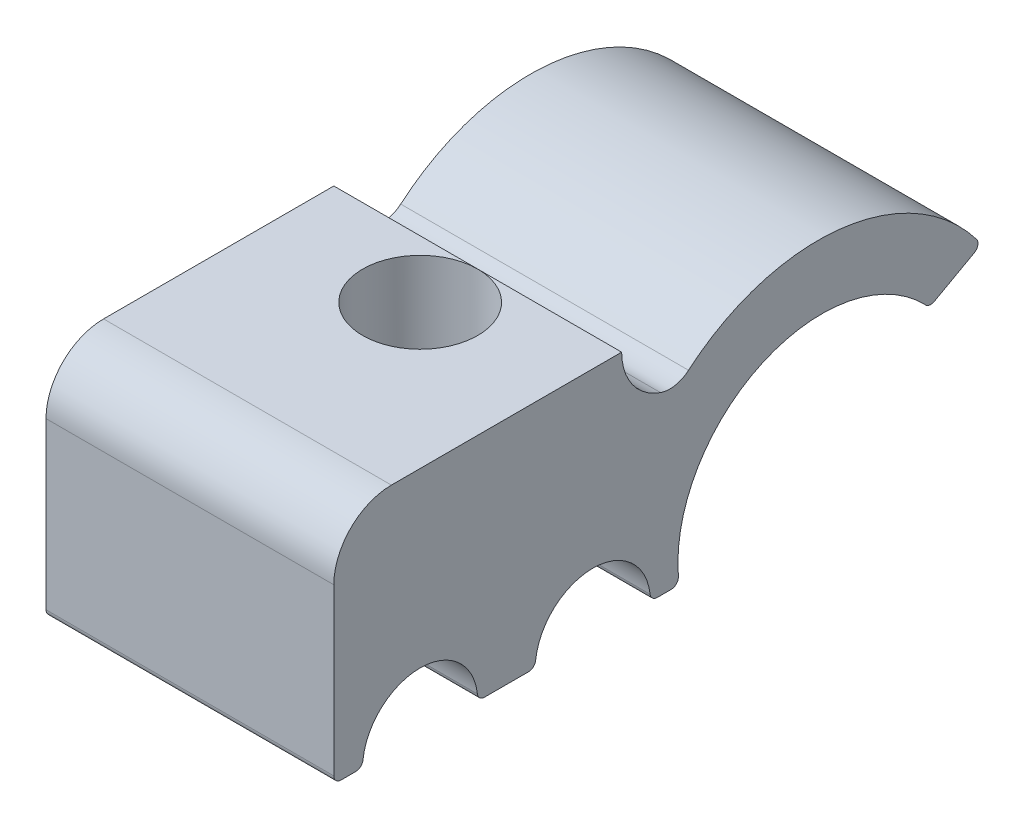
ISO-10303-21;
HEADER;
FILE_DESCRIPTION(('STEP AP214'),'2;1');
FILE_NAME('part.step','',(''),(''),'','','');
FILE_SCHEMA(('AUTOMOTIVE_DESIGN { 1 0 10303 214 1 1 1 1 }'));
ENDSEC;
DATA;
#1=APPLICATION_CONTEXT('core data for automotive mechanical design processes');
#2=APPLICATION_PROTOCOL_DEFINITION('international standard','automotive_design',2000,#1);
#3=PRODUCT_CONTEXT('',#1,'mechanical');
#4=PRODUCT('Part','Part','',(#3));
#5=PRODUCT_RELATED_PRODUCT_CATEGORY('part','',(#4));
#6=PRODUCT_DEFINITION_FORMATION('','',#4);
#7=PRODUCT_DEFINITION_CONTEXT('part definition',#1,'design');
#8=PRODUCT_DEFINITION('design','',#6,#7);
#9=PRODUCT_DEFINITION_SHAPE('','',#8);
#10=(LENGTH_UNIT() NAMED_UNIT(*) SI_UNIT(.MILLI.,.METRE.));
#11=(NAMED_UNIT(*) PLANE_ANGLE_UNIT() SI_UNIT($,.RADIAN.));
#12=(NAMED_UNIT(*) SI_UNIT($,.STERADIAN.) SOLID_ANGLE_UNIT());
#13=UNCERTAINTY_MEASURE_WITH_UNIT(LENGTH_MEASURE(1.E-05),#10,'distance_accuracy_value','');
#14=(GEOMETRIC_REPRESENTATION_CONTEXT(3) GLOBAL_UNCERTAINTY_ASSIGNED_CONTEXT((#13)) GLOBAL_UNIT_ASSIGNED_CONTEXT((#10,
#11,#12)) REPRESENTATION_CONTEXT('',''));
#15=CARTESIAN_POINT('',(0.,0.,0.));
#16=DIRECTION('',(0.,0.,1.));
#17=DIRECTION('',(1.,0.,0.));
#18=AXIS2_PLACEMENT_3D('',#15,#16,#17);
#19=CARTESIAN_POINT('',(10.,0.25,-6.76393202250021));
#20=DIRECTION('',(-1.,0.,0.));
#21=DIRECTION('',(0.,0.,1.));
#22=AXIS2_PLACEMENT_3D('',#19,#20,#21);
#23=CYLINDRICAL_SURFACE('',#22,0.25);
#24=CARTESIAN_POINT('',(3.42769724448515,0.,-6.76393202250021));
#25=CARTESIAN_POINT('',(3.41462216458237,-6.66335307561096E-06,-6.78053572250182));
#26=CARTESIAN_POINT('',(3.40178705927744,0.00165795491346707,-6.79743135554813));
#27=CARTESIAN_POINT('',(3.37691964203436,0.00860654667064835,-6.83122529822522));
#28=CARTESIAN_POINT('',(3.36489292534722,0.0139133612981023,-6.84812294796678));
#29=CARTESIAN_POINT('',(3.34481852426824,0.0267214341193866,-6.87722963671423));
#30=CARTESIAN_POINT('',(3.33650057341184,0.0334121662525097,-6.88960610139683));
#31=CARTESIAN_POINT('',(3.32084055404152,0.0491216688566913,-6.91343425636235));
#32=CARTESIAN_POINT('',(3.31349626369011,0.0581349958205819,-6.92488802787665));
#33=CARTESIAN_POINT('',(3.29991981335179,0.0785455318655004,-6.94648580549413));
#34=CARTESIAN_POINT('',(3.29369823947737,0.08996343375631,-6.95661711781856));
#35=CARTESIAN_POINT('',(3.28267856853263,0.114909697294025,-6.9748558122233));
#36=CARTESIAN_POINT('',(3.27787881113242,0.128435568947731,-6.98296555322999));
#37=CARTESIAN_POINT('',(3.27048659105514,0.155049283281002,-6.99559451731005));
#38=CARTESIAN_POINT('',(3.26767316640282,0.167908310560443,-7.00046661761241));
#39=CARTESIAN_POINT('',(3.26329496078325,0.194513691956269,-7.00809726169115));
#40=CARTESIAN_POINT('',(3.26173700288276,0.208264461703602,-7.01084425298392));
#41=CARTESIAN_POINT('',(3.26085806328264,0.222222222222222,-7.01238402000019));
#42=B_SPLINE_CURVE_WITH_KNOTS('',3,(#24,#25,#26,#27,#28,#29,#30,#31,#32,#33,#34,#35,#36,#37,#38,
#39,#40,#41),.UNSPECIFIED.,.F.,.F.,(4,2,2,2,2,2,2,2,4),(0.,0.0634656840286306,0.127333058526832,
0.176167595364742,0.224888702641326,0.274047597065556,0.323148857693378,0.365019409150561,
0.407116007616478),.UNSPECIFIED.);
#43=CARTESIAN_POINT('',(3.42769724448515,0.,-6.76393202250021));
#44=VERTEX_POINT('',#43);
#45=CARTESIAN_POINT('',(3.26085806328264,0.222222222222222,-7.01238402000019));
#46=VERTEX_POINT('',#45);
#47=EDGE_CURVE('E11',#44,#46,#42,.T.);
#48=ORIENTED_EDGE('',*,*,#47,.F.);
#49=DIRECTION('',(-1.,0.,0.));
#50=VECTOR('',#49,1.);
#51=CARTESIAN_POINT('',(10.,0.,-6.76393202250021));
#52=LINE('',#51,#50);
#53=CARTESIAN_POINT('',(0.,0.,-6.76393202250021));
#54=VERTEX_POINT('',#53);
#55=EDGE_CURVE('E213',#54,#44,#52,.F.);
#56=ORIENTED_EDGE('',*,*,#55,.F.);
#57=CARTESIAN_POINT('',(0.,0.25,-6.76393202250021));
#58=DIRECTION('',(-1.,0.,0.));
#59=DIRECTION('',(0.,0.,1.));
#60=AXIS2_PLACEMENT_3D('',#57,#58,#59);
#61=CIRCLE('',#60,0.25);
#62=CARTESIAN_POINT('',(0.,0.222222222222222,-7.01238402000019));
#63=VERTEX_POINT('',#62);
#64=EDGE_CURVE('E348',#63,#54,#61,.T.);
#65=ORIENTED_EDGE('',*,*,#64,.F.);
#66=DIRECTION('',(-1.,0.,0.));
#67=VECTOR('',#66,1.);
#68=CARTESIAN_POINT('',(10.,0.222222222222222,-7.01238402000019));
#69=LINE('',#68,#67);
#70=EDGE_CURVE('E316',#46,#63,#69,.T.);
#71=ORIENTED_EDGE('',*,*,#70,.F.);
#72=EDGE_LOOP('',(#48,#56,#65,#71));
#73=FACE_BOUND('',#72,.T.);
#74=ADVANCED_FACE('F37',(#73),#23,.T.);
#75=CARTESIAN_POINT('',(10.,0.,0.));
#76=DIRECTION('',(0.,1.,0.));
#77=DIRECTION('',(0.,0.,1.));
#78=AXIS2_PLACEMENT_3D('',#75,#76,#77);
#79=PLANE('',#78);
#80=DIRECTION('',(0.,0.,-1.));
#81=VECTOR('',#80,1.);
#82=CARTESIAN_POINT('',(0.,0.,0.));
#83=LINE('',#82,#81);
#84=CARTESIAN_POINT('',(0.,0.,-0.25));
#85=VERTEX_POINT('',#84);
#86=CARTESIAN_POINT('',(0.,0.,-0.76393202250021));
#87=VERTEX_POINT('',#86);
#88=EDGE_CURVE('E265',#85,#87,#83,.T.);
#89=ORIENTED_EDGE('',*,*,#88,.T.);
#90=DIRECTION('',(-1.,0.,0.));
#91=VECTOR('',#90,1.);
#92=CARTESIAN_POINT('',(10.,0.,-0.76393202250021));
#93=LINE('',#92,#91);
#94=CARTESIAN_POINT('',(10.,0.,-0.76393202250021));
#95=VERTEX_POINT('',#94);
#96=EDGE_CURVE('E241',#87,#95,#93,.F.);
#97=ORIENTED_EDGE('',*,*,#96,.T.);
#98=DIRECTION('',(0.,0.,-1.));
#99=VECTOR('',#98,1.);
#100=CARTESIAN_POINT('',(10.,0.,0.));
#101=LINE('',#100,#99);
#102=CARTESIAN_POINT('',(10.,0.,-0.25));
#103=VERTEX_POINT('',#102);
#104=EDGE_CURVE('E266',#103,#95,#101,.T.);
#105=ORIENTED_EDGE('',*,*,#104,.F.);
#106=DIRECTION('',(-1.,0.,0.));
#107=VECTOR('',#106,1.);
#108=CARTESIAN_POINT('',(10.,0.,-0.25));
#109=LINE('',#108,#107);
#110=EDGE_CURVE('E238',#103,#85,#109,.T.);
#111=ORIENTED_EDGE('',*,*,#110,.T.);
#112=EDGE_LOOP('',(#89,#97,#105,#111));
#113=FACE_BOUND('',#112,.T.);
#114=ADVANCED_FACE('F281',(#113),#79,.F.);
#115=CARTESIAN_POINT('',(10.,0.,-3.));
#116=DIRECTION('',(-1.,0.,0.));
#117=DIRECTION('',(0.,0.,1.));
#118=AXIS2_PLACEMENT_3D('',#115,#116,#117);
#119=CYLINDRICAL_SURFACE('',#118,2.);
#120=CARTESIAN_POINT('',(0.,0.,-3.));
#121=DIRECTION('',(-1.,0.,0.));
#122=DIRECTION('',(0.,0.,1.));
#123=AXIS2_PLACEMENT_3D('',#120,#121,#122);
#124=CIRCLE('',#123,2.);
#125=CARTESIAN_POINT('',(0.,0.222222222222222,-1.01238402000019));
#126=VERTEX_POINT('',#125);
#127=CARTESIAN_POINT('',(0.,0.222222222222222,-4.98761597999981));
#128=VERTEX_POINT('',#127);
#129=EDGE_CURVE('E415',#126,#128,#124,.T.);
#130=ORIENTED_EDGE('',*,*,#129,.T.);
#131=DIRECTION('',(-1.,0.,0.));
#132=VECTOR('',#131,1.);
#133=CARTESIAN_POINT('',(10.,0.222222222222222,-4.98761597999981));
#134=LINE('',#133,#132);
#135=CARTESIAN_POINT('',(10.,0.222222222222222,-4.98761597999981));
#136=VERTEX_POINT('',#135);
#137=EDGE_CURVE('E228',#128,#136,#134,.F.);
#138=ORIENTED_EDGE('',*,*,#137,.T.);
#139=CARTESIAN_POINT('',(10.,0.,-3.));
#140=DIRECTION('',(-1.,0.,0.));
#141=DIRECTION('',(0.,0.,1.));
#142=AXIS2_PLACEMENT_3D('',#139,#140,#141);
#143=CIRCLE('',#142,2.);
#144=CARTESIAN_POINT('',(10.,0.222222222222222,-1.01238402000019));
#145=VERTEX_POINT('',#144);
#146=EDGE_CURVE('E439',#145,#136,#143,.T.);
#147=ORIENTED_EDGE('',*,*,#146,.F.);
#148=DIRECTION('',(-1.,0.,0.));
#149=VECTOR('',#148,1.);
#150=CARTESIAN_POINT('',(10.,0.222222222222222,-1.01238402000019));
#151=LINE('',#150,#149);
#152=EDGE_CURVE('E220',#145,#126,#151,.T.);
#153=ORIENTED_EDGE('',*,*,#152,.T.);
#154=EDGE_LOOP('',(#130,#138,#147,#153));
#155=FACE_BOUND('',#154,.T.);
#156=ADVANCED_FACE('F278',(#155),#119,.F.);
#157=CARTESIAN_POINT('',(10.,0.,-5.));
#158=DIRECTION('',(0.,1.,0.));
#159=DIRECTION('',(0.,0.,1.));
#160=AXIS2_PLACEMENT_3D('',#157,#158,#159);
#161=PLANE('',#160);
#162=ORIENTED_EDGE('',*,*,#55,.T.);
#163=CARTESIAN_POINT('',(5.,0.,-8.));
#164=DIRECTION('',(0.,1.,0.));
#165=DIRECTION('',(0.,0.,1.));
#166=AXIS2_PLACEMENT_3D('',#163,#164,#165);
#167=CIRCLE('',#166,2.);
#168=CARTESIAN_POINT('',(6.57230275551485,0.,-6.76393202250021));
#169=VERTEX_POINT('',#168);
#170=EDGE_CURVE('E198',#44,#169,#167,.T.);
#171=ORIENTED_EDGE('',*,*,#170,.T.);
#172=CARTESIAN_POINT('',(10.,0.,-6.76393202250021));
#173=VERTEX_POINT('',#172);
#174=EDGE_CURVE('E209',#169,#173,#52,.F.);
#175=ORIENTED_EDGE('',*,*,#174,.T.);
#176=DIRECTION('',(0.,0.,-1.));
#177=VECTOR('',#176,1.);
#178=CARTESIAN_POINT('',(10.,0.,-5.));
#179=LINE('',#178,#177);
#180=CARTESIAN_POINT('',(10.,0.,-5.23606797749979));
#181=VERTEX_POINT('',#180);
#182=EDGE_CURVE('E438',#181,#173,#179,.T.);
#183=ORIENTED_EDGE('',*,*,#182,.F.);
#184=DIRECTION('',(-1.,0.,0.));
#185=VECTOR('',#184,1.);
#186=CARTESIAN_POINT('',(10.,0.,-5.23606797749979));
#187=LINE('',#186,#185);
#188=CARTESIAN_POINT('',(0.,0.,-5.23606797749979));
#189=VERTEX_POINT('',#188);
#190=EDGE_CURVE('E218',#181,#189,#187,.T.);
#191=ORIENTED_EDGE('',*,*,#190,.T.);
#192=DIRECTION('',(0.,0.,-1.));
#193=VECTOR('',#192,1.);
#194=CARTESIAN_POINT('',(0.,0.,-5.));
#195=LINE('',#194,#193);
#196=EDGE_CURVE('E413',#189,#54,#195,.T.);
#197=ORIENTED_EDGE('',*,*,#196,.T.);
#198=EDGE_LOOP('',(#162,#171,#175,#183,#191,#197));
#199=FACE_BOUND('',#198,.T.);
#200=ADVANCED_FACE('F207',(#199),#161,.F.);
#201=CARTESIAN_POINT('',(10.,0.,-9.));
#202=DIRECTION('',(-1.,0.,0.));
#203=DIRECTION('',(0.,0.,1.));
#204=AXIS2_PLACEMENT_3D('',#201,#202,#203);
#205=CYLINDRICAL_SURFACE('',#204,2.);
#206=CARTESIAN_POINT('',(10.,0.222222222222222,-7.01238402000019));
#207=VERTEX_POINT('',#206);
#208=CARTESIAN_POINT('',(6.73914193671736,0.222222222222222,-7.01238402000019));
#209=VERTEX_POINT('',#208);
#210=EDGE_CURVE('E319',#207,#209,#69,.T.);
#211=ORIENTED_EDGE('',*,*,#210,.T.);
#212=CARTESIAN_POINT('',(6.73914193671736,0.222222222222222,-7.01238402000019));
#213=CARTESIAN_POINT('',(6.7426255851985,0.277442256718557,-7.01855062763638));
#214=CARTESIAN_POINT('',(6.74741045025124,0.332298346350473,-7.02702036408333));
#215=CARTESIAN_POINT('',(6.75915928360581,0.44084612362074,-7.04840989555838));
#216=CARTESIAN_POINT('',(6.766121142507,0.494538884844337,-7.06132538408577));
#217=CARTESIAN_POINT('',(6.78179077242562,0.600308765551071,-7.09142772657047));
#218=CARTESIAN_POINT('',(6.7904944536125,0.652389345743301,-7.10860459695475));
#219=CARTESIAN_POINT('',(6.80913943017905,0.754771928210748,-7.14708009179252));
#220=CARTESIAN_POINT('',(6.8190810163328,0.805073509036793,-7.16837968529496));
#221=CARTESIAN_POINT('',(6.84988645060893,0.952627220903128,-7.23809653734827));
#222=CARTESIAN_POINT('',(6.87179805785816,1.04693050202165,-7.29244753043365));
#223=CARTESIAN_POINT('',(6.91392126719587,1.22575911341328,-7.41591428847535));
#224=CARTESIAN_POINT('',(6.9341325061036,1.31028235621309,-7.48503319659994));
#225=CARTESIAN_POINT('',(6.96617437848358,1.45781941283292,-7.62744182597922));
#226=CARTESIAN_POINT('',(6.97873500604486,1.52220100357749,-7.69914163589193));
#227=CARTESIAN_POINT('',(6.99596546903928,1.64032217864305,-7.85168561473619));
#228=CARTESIAN_POINT('',(7.00064260824099,1.69407157250883,-7.93252124547142));
#229=CARTESIAN_POINT('',(6.99920975976636,1.78964744624058,-8.10184852779639));
#230=CARTESIAN_POINT('',(6.99301179967036,1.83137348263313,-8.19039705879564));
#231=CARTESIAN_POINT('',(6.96740193990041,1.9009595523946,-8.3709611686339));
#232=CARTESIAN_POINT('',(6.94800108150317,1.92883113824284,-8.46297378984331));
#233=CARTESIAN_POINT('',(6.89878005616119,1.96782713091417,-8.63358299752007));
#234=CARTESIAN_POINT('',(6.87073721894075,1.98071449668247,-8.71230121449843));
#235=CARTESIAN_POINT('',(6.80455231145488,1.99703534717652,-8.86638395600082));
#236=CARTESIAN_POINT('',(6.76640853031923,2.00046722923426,-8.94174790986068));
#237=CARTESIAN_POINT('',(6.68073551544778,1.99942703562974,-9.08734011539935));
#238=CARTESIAN_POINT('',(6.63315833346895,1.99491361173732,-9.15753950810639));
#239=CARTESIAN_POINT('',(6.5299005329799,1.97986498682557,-9.29094137059753));
#240=CARTESIAN_POINT('',(6.47421738471681,1.96932790289462,-9.35414164517814));
#241=CARTESIAN_POINT('',(6.34647277406436,1.9423092157949,-9.48203220775079));
#242=CARTESIAN_POINT('',(6.27321354388973,1.9251515733684,-9.54538122489183));
#243=CARTESIAN_POINT('',(6.1186384859977,1.88868315588815,-9.66071358191499));
#244=CARTESIAN_POINT('',(6.03731256716181,1.86936968008719,-9.71268241830911));
#245=CARTESIAN_POINT('',(5.8537167323629,1.82860723502318,-9.81212428138482));
#246=CARTESIAN_POINT('',(5.75021169563562,1.80733637514872,-9.85741692076671));
#247=CARTESIAN_POINT('',(5.53610161848874,1.77103330296846,-9.93011500848399));
#248=CARTESIAN_POINT('',(5.42550445183062,1.75599430584888,-9.95753992865696));
#249=CARTESIAN_POINT('',(5.2045055199914,1.73645462531368,-9.99253690822956));
#250=CARTESIAN_POINT('',(5.09425154098639,1.73158038456918,-10.00081397429));
#251=CARTESIAN_POINT('',(4.8739652079104,1.73259413133676,-9.99905975228232));
#252=CARTESIAN_POINT('',(4.76393279549155,1.73847876619264,-9.98903416764581));
#253=CARTESIAN_POINT('',(4.5594987253727,1.75825680371142,-9.95334906076431));
#254=CARTESIAN_POINT('',(4.46468221630578,1.77122838797094,-9.92947237034803));
#255=CARTESIAN_POINT('',(4.28017196447877,1.80190585426156,-9.86850195622635));
#256=CARTESIAN_POINT('',(4.19048258082058,1.81961569420324,-9.83139717431392));
#257=CARTESIAN_POINT('',(4.0084971107006,1.85870607509562,-9.74021764559572));
#258=CARTESIAN_POINT('',(3.91693503073994,1.88027670906123,-9.68475956960494));
#259=CARTESIAN_POINT('',(3.74349064653647,1.92121887503449,-9.55968059706874));
#260=CARTESIAN_POINT('',(3.661605376075,1.94059108085054,-9.4900640583936));
#261=CARTESIAN_POINT('',(3.51854774845365,1.970866467418,-9.34694700158683));
#262=CARTESIAN_POINT('',(3.45606898868843,1.98250697466905,-9.27491505669816));
#263=CARTESIAN_POINT('',(3.34169333022103,1.99774179624037,-9.12209847349342));
#264=CARTESIAN_POINT('',(3.28978814872674,2.00134243077694,-9.04132076271918));
#265=CARTESIAN_POINT('',(3.19781704202052,1.99773123016735,-8.87259748331745));
#266=CARTESIAN_POINT('',(3.15784543479424,1.99043585823397,-8.78460147482025));
#267=CARTESIAN_POINT('',(3.0915037966478,1.96280682096248,-8.60558514527243));
#268=CARTESIAN_POINT('',(3.06512351750154,1.94248300544912,-8.51456715816224));
#269=CARTESIAN_POINT('',(3.02842086000102,1.89167019455439,-8.34551478310752));
#270=CARTESIAN_POINT('',(3.01646059476589,1.86283975150181,-8.26732632421438));
#271=CARTESIAN_POINT('',(3.00180359261978,1.79522880537913,-8.11448504860185));
#272=CARTESIAN_POINT('',(2.99910816123641,1.75644690085461,-8.03983273162936));
#273=CARTESIAN_POINT('',(3.00142005635091,1.66929735717081,-7.89515447909457));
#274=CARTESIAN_POINT('',(3.00653289694046,1.62080624208331,-7.82520549099185));
#275=CARTESIAN_POINT('',(3.02265676611375,1.51573949655985,-7.69244061812004));
#276=CARTESIAN_POINT('',(3.0336709813186,1.45915951041302,-7.62962860940459));
#277=CARTESIAN_POINT('',(3.06160783716384,1.32927090622429,-7.50247273722137));
#278=CARTESIAN_POINT('',(3.07919880946545,1.25473728891363,-7.43953095309275));
#279=CARTESIAN_POINT('',(3.1162886091784,1.09761741930192,-7.32528322067324));
#280=CARTESIAN_POINT('',(3.13578829375553,1.01502754915157,-7.27398253480797));
#281=CARTESIAN_POINT('',(3.16654057903747,0.874733539229323,-7.20038637719115));
#282=CARTESIAN_POINT('',(3.17818993200125,0.819041095614128,-7.17436067798881));
#283=CARTESIAN_POINT('',(3.20017971468313,0.705265959640024,-7.1274657184958));
#284=CARTESIAN_POINT('',(3.21052026828726,0.647183494202316,-7.10659596998387));
#285=CARTESIAN_POINT('',(3.22916268536355,0.528811784250987,-7.07018089574535));
#286=CARTESIAN_POINT('',(3.23745714093993,0.468515403502646,-7.05465483896419));
#287=CARTESIAN_POINT('',(3.2513453926623,0.346378653343036,-7.0292313082934));
#288=CARTESIAN_POINT('',(3.256936205314,0.284536657084462,-7.01934005032281));
#289=CARTESIAN_POINT('',(3.26085806328264,0.222222222222222,-7.01238402000019));
#290=B_SPLINE_CURVE_WITH_KNOTS('',3,(#212,#213,#214,#215,#216,#217,#218,#219,#220,#221,#222,
#223,#224,#225,#226,#227,#228,#229,#230,#231,#232,#233,#234,#235,#236,#237,#238,#239,#240,#241,
#242,#243,#244,#245,#246,#247,#248,#249,#250,#251,#252,#253,#254,#255,#256,#257,#258,#259,#260,
#261,#262,#263,#264,#265,#266,#267,#268,#269,#270,#271,#272,#273,#274,#275,#276,#277,#278,#279,
#280,#281,#282,#283,#284,#285,#286,#287,#288,#289),.UNSPECIFIED.,.F.,.F.,(4,2,2,2,2,2,2,2,2,2,2,
2,2,2,2,2,2,2,2,2,2,2,2,2,2,2,2,2,2,2,2,2,2,2,2,2,2,2,4),(0.,0.166917876839146,
0.333674516968874,0.500044108869144,0.666452853651021,0.998014049091706,1.32964588365913,
1.62000064972558,1.91008626437918,2.20252931198073,2.49472809631172,2.74716056805694,
2.99963582350061,3.25342887441323,3.50730130088571,3.80127129985837,4.09561379660299,
4.43884460934565,4.78170074843658,5.11171729989874,5.44163102988536,5.73633274641694,
6.03128140286722,6.3575407247083,6.68369977790285,6.97071946671757,7.25751344721909,
7.54651751706032,7.83530334996811,8.08666660026536,8.33806526924565,8.5928913023213,
8.84785507510247,9.14414737743012,9.44057335474996,9.62803859178421,9.81548607077026,
10.0036025582559,10.1919261629434),.UNSPECIFIED.);
#291=EDGE_CURVE('E62',#209,#46,#290,.T.);
#292=ORIENTED_EDGE('',*,*,#291,.T.);
#293=ORIENTED_EDGE('',*,*,#70,.T.);
#294=CARTESIAN_POINT('',(0.,0.,-9.));
#295=DIRECTION('',(-1.,0.,0.));
#296=DIRECTION('',(0.,0.,1.));
#297=AXIS2_PLACEMENT_3D('',#294,#295,#296);
#298=CIRCLE('',#297,2.);
#299=CARTESIAN_POINT('',(0.,0.222222222222222,-10.9876159799998));
#300=VERTEX_POINT('',#299);
#301=EDGE_CURVE('E411',#63,#300,#298,.T.);
#302=ORIENTED_EDGE('',*,*,#301,.T.);
#303=DIRECTION('',(-1.,0.,0.));
#304=VECTOR('',#303,1.);
#305=CARTESIAN_POINT('',(10.,0.222222222222222,-10.9876159799998));
#306=LINE('',#305,#304);
#307=CARTESIAN_POINT('',(10.,0.222222222222222,-10.9876159799998));
#308=VERTEX_POINT('',#307);
#309=EDGE_CURVE('E222',#300,#308,#306,.F.);
#310=ORIENTED_EDGE('',*,*,#309,.T.);
#311=CARTESIAN_POINT('',(10.,0.,-9.));
#312=DIRECTION('',(-1.,0.,0.));
#313=DIRECTION('',(0.,0.,1.));
#314=AXIS2_PLACEMENT_3D('',#311,#312,#313);
#315=CIRCLE('',#314,2.);
#316=EDGE_CURVE('E321',#207,#308,#315,.T.);
#317=ORIENTED_EDGE('',*,*,#316,.F.);
#318=EDGE_LOOP('',(#211,#292,#293,#302,#310,#317));
#319=FACE_BOUND('',#318,.T.);
#320=ADVANCED_FACE('F268',(#319),#205,.F.);
#321=CARTESIAN_POINT('',(10.,0.,-11.));
#322=DIRECTION('',(0.,1.,0.));
#323=DIRECTION('',(0.,0.,1.));
#324=AXIS2_PLACEMENT_3D('',#321,#322,#323);
#325=PLANE('',#324);
#326=DIRECTION('',(0.,0.,-1.));
#327=VECTOR('',#326,1.);
#328=CARTESIAN_POINT('',(0.,0.,-11.));
#329=LINE('',#328,#327);
#330=CARTESIAN_POINT('',(0.,0.,-11.2360679774998));
#331=VERTEX_POINT('',#330);
#332=CARTESIAN_POINT('',(0.,0.,-11.7213952276809));
#333=VERTEX_POINT('',#332);
#334=EDGE_CURVE('E408',#331,#333,#329,.T.);
#335=ORIENTED_EDGE('',*,*,#334,.T.);
#336=DIRECTION('',(-1.,0.,0.));
#337=VECTOR('',#336,1.);
#338=CARTESIAN_POINT('',(10.,0.,-11.7213952276809));
#339=LINE('',#338,#337);
#340=CARTESIAN_POINT('',(10.,0.,-11.7213952276809));
#341=VERTEX_POINT('',#340);
#342=EDGE_CURVE('E339',#333,#341,#339,.F.);
#343=ORIENTED_EDGE('',*,*,#342,.T.);
#344=DIRECTION('',(0.,0.,-1.));
#345=VECTOR('',#344,1.);
#346=CARTESIAN_POINT('',(10.,0.,-11.));
#347=LINE('',#346,#345);
#348=CARTESIAN_POINT('',(10.,0.,-11.2360679774998));
#349=VERTEX_POINT('',#348);
#350=EDGE_CURVE('E434',#349,#341,#347,.T.);
#351=ORIENTED_EDGE('',*,*,#350,.F.);
#352=DIRECTION('',(-1.,0.,0.));
#353=VECTOR('',#352,1.);
#354=CARTESIAN_POINT('',(10.,0.,-11.2360679774998));
#355=LINE('',#354,#353);
#356=EDGE_CURVE('E341',#349,#331,#355,.T.);
#357=ORIENTED_EDGE('',*,*,#356,.T.);
#358=EDGE_LOOP('',(#335,#343,#351,#357));
#359=FACE_BOUND('',#358,.T.);
#360=ADVANCED_FACE('F273',(#359),#325,.F.);
#361=CARTESIAN_POINT('',(10.,0.676152362691742,-16.9540708495566));
#362=DIRECTION('',(-1.,0.,0.));
#363=DIRECTION('',(0.,0.,1.));
#364=AXIS2_PLACEMENT_3D('',#361,#362,#363);
#365=CYLINDRICAL_SURFACE('',#364,5.);
#366=CARTESIAN_POINT('',(10.,0.676152362691742,-16.9540708495566));
#367=DIRECTION('',(-1.,0.,0.));
#368=DIRECTION('',(0.,0.,1.));
#369=AXIS2_PLACEMENT_3D('',#366,#367,#368);
#370=CIRCLE('',#369,5.);
#371=CARTESIAN_POINT('',(10.,0.270292969651988,-11.970570257294));
#372=VERTEX_POINT('',#371);
#373=CARTESIAN_POINT('',(10.,4.14029822189488,-20.5595796161755));
#374=VERTEX_POINT('',#373);
#375=EDGE_CURVE('E431',#372,#374,#370,.T.);
#376=ORIENTED_EDGE('',*,*,#375,.F.);
#377=DIRECTION('',(-1.,0.,0.));
#378=VECTOR('',#377,1.);
#379=CARTESIAN_POINT('',(10.,0.270292969651988,-11.970570257294));
#380=LINE('',#379,#378);
#381=CARTESIAN_POINT('',(0.,0.270292969651988,-11.970570257294));
#382=VERTEX_POINT('',#381);
#383=EDGE_CURVE('E360',#372,#382,#380,.T.);
#384=ORIENTED_EDGE('',*,*,#383,.T.);
#385=CARTESIAN_POINT('',(0.,0.676152362691742,-16.9540708495566));
#386=DIRECTION('',(-1.,0.,0.));
#387=DIRECTION('',(0.,0.,1.));
#388=AXIS2_PLACEMENT_3D('',#385,#386,#387);
#389=CIRCLE('',#388,5.);
#390=CARTESIAN_POINT('',(0.,4.14029822189488,-20.5595796161755));
#391=VERTEX_POINT('',#390);
#392=EDGE_CURVE('E405',#382,#391,#389,.T.);
#393=ORIENTED_EDGE('',*,*,#392,.T.);
#394=DIRECTION('',(-1.,0.,0.));
#395=VECTOR('',#394,1.);
#396=CARTESIAN_POINT('',(10.,4.14029822189488,-20.5595796161755));
#397=LINE('',#396,#395);
#398=EDGE_CURVE('E363',#391,#374,#397,.F.);
#399=ORIENTED_EDGE('',*,*,#398,.T.);
#400=EDGE_LOOP('',(#376,#384,#393,#399));
#401=FACE_BOUND('',#400,.T.);
#402=ADVANCED_FACE('F472',(#401),#365,.F.);
#403=CARTESIAN_POINT('',(10.,5.,-22.5));
#404=DIRECTION('',(0.,0.875373019482321,0.48344811175803));
#405=DIRECTION('',(0.,-0.48344811175803,0.875373019482321));
#406=AXIS2_PLACEMENT_3D('',#403,#404,#405);
#407=PLANE('',#406);
#408=DIRECTION('',(0.,0.48344811175803,-0.87537301948232));
#409=VECTOR('',#408,1.);
#410=CARTESIAN_POINT('',(0.,5.,-22.5));
#411=LINE('',#410,#409);
#412=CARTESIAN_POINT('',(0.,4.09466225998446,-20.8607170824459));
#413=VERTEX_POINT('',#412);
#414=CARTESIAN_POINT('',(0.,4.86263966758559,-22.2512834862351));
#415=VERTEX_POINT('',#414);
#416=EDGE_CURVE('E402',#413,#415,#411,.T.);
#417=ORIENTED_EDGE('',*,*,#416,.T.);
#418=DIRECTION('',(-1.,0.,0.));
#419=VECTOR('',#418,1.);
#420=CARTESIAN_POINT('',(10.,4.86263966758559,-22.2512834862351));
#421=LINE('',#420,#419);
#422=CARTESIAN_POINT('',(10.,4.86263966758559,-22.2512834862351));
#423=VERTEX_POINT('',#422);
#424=EDGE_CURVE('E236',#415,#423,#421,.F.);
#425=ORIENTED_EDGE('',*,*,#424,.T.);
#426=DIRECTION('',(0.,0.48344811175803,-0.87537301948232));
#427=VECTOR('',#426,1.);
#428=CARTESIAN_POINT('',(10.,5.,-22.5));
#429=LINE('',#428,#427);
#430=CARTESIAN_POINT('',(10.,4.09466225998446,-20.8607170824459));
#431=VERTEX_POINT('',#430);
#432=EDGE_CURVE('E428',#431,#423,#429,.T.);
#433=ORIENTED_EDGE('',*,*,#432,.F.);
#434=DIRECTION('',(-1.,0.,0.));
#435=VECTOR('',#434,1.);
#436=CARTESIAN_POINT('',(10.,4.09466225998446,-20.8607170824459));
#437=LINE('',#436,#435);
#438=EDGE_CURVE('E233',#431,#413,#437,.T.);
#439=ORIENTED_EDGE('',*,*,#438,.T.);
#440=EDGE_LOOP('',(#417,#425,#433,#439));
#441=FACE_BOUND('',#440,.T.);
#442=ADVANCED_FACE('F481',(#441),#407,.F.);
#443=CARTESIAN_POINT('',(10.,1.01958852759629,-16.8232941454854));
#444=DIRECTION('',(-1.,0.,0.));
#445=DIRECTION('',(0.,0.,1.));
#446=AXIS2_PLACEMENT_3D('',#443,#444,#445);
#447=CYLINDRICAL_SURFACE('',#446,6.93315691790716);
#448=CARTESIAN_POINT('',(10.,1.01958852759629,-16.8232941454854));
#449=DIRECTION('',(1.,0.,0.));
#450=DIRECTION('',(0.,0.,1.));
#451=AXIS2_PLACEMENT_3D('',#448,#449,#450);
#452=CIRCLE('',#451,6.93315691790716);
#453=CARTESIAN_POINT('',(10.,5.23342812009086,-22.3289476704585));
#454=VERTEX_POINT('',#453);
#455=CARTESIAN_POINT('',(10.,6.29385251683159,-12.3232047885748));
#456=VERTEX_POINT('',#455);
#457=EDGE_CURVE('E426',#454,#456,#452,.T.);
#458=ORIENTED_EDGE('',*,*,#457,.F.);
#459=DIRECTION('',(-1.,0.,0.));
#460=VECTOR('',#459,1.);
#461=CARTESIAN_POINT('',(10.,5.23342812009086,-22.3289476704585));
#462=LINE('',#461,#460);
#463=CARTESIAN_POINT('',(0.,5.23342812009086,-22.3289476704585));
#464=VERTEX_POINT('',#463);
#465=EDGE_CURVE('E230',#454,#464,#462,.T.);
#466=ORIENTED_EDGE('',*,*,#465,.T.);
#467=CARTESIAN_POINT('',(0.,1.01958852759629,-16.8232941454854));
#468=DIRECTION('',(1.,0.,0.));
#469=DIRECTION('',(0.,0.,1.));
#470=AXIS2_PLACEMENT_3D('',#467,#468,#469);
#471=CIRCLE('',#470,6.93315691790716);
#472=CARTESIAN_POINT('',(0.,6.29385251683159,-12.3232047885748));
#473=VERTEX_POINT('',#472);
#474=EDGE_CURVE('E400',#464,#473,#471,.T.);
#475=ORIENTED_EDGE('',*,*,#474,.T.);
#476=DIRECTION('',(-1.,0.,0.));
#477=VECTOR('',#476,1.);
#478=CARTESIAN_POINT('',(10.,6.29385251683159,-12.3232047885748));
#479=LINE('',#478,#477);
#480=EDGE_CURVE('E370',#473,#456,#479,.F.);
#481=ORIENTED_EDGE('',*,*,#480,.T.);
#482=EDGE_LOOP('',(#458,#466,#475,#481));
#483=FACE_BOUND('',#482,.T.);
#484=ADVANCED_FACE('F490',(#483),#447,.T.);
#485=CARTESIAN_POINT('',(10.,8.,0.));
#486=DIRECTION('',(0.,-1.,0.));
#487=DIRECTION('',(0.,0.,-1.));
#488=AXIS2_PLACEMENT_3D('',#485,#486,#487);
#489=PLANE('',#488);
#490=DIRECTION('',(-1.,0.,0.));
#491=VECTOR('',#490,1.);
#492=CARTESIAN_POINT('',(10.,8.,-10.));
#493=LINE('',#492,#491);
#494=CARTESIAN_POINT('',(10.,8.,-10.));
#495=VERTEX_POINT('',#494);
#496=CARTESIAN_POINT('',(5.,8.,-10.));
#497=VERTEX_POINT('',#496);
#498=EDGE_CURVE('E390',#495,#497,#493,.T.);
#499=ORIENTED_EDGE('',*,*,#498,.T.);
#500=CARTESIAN_POINT('',(5.,8.,-8.));
#501=DIRECTION('',(0.,1.,0.));
#502=DIRECTION('',(0.,0.,1.));
#503=AXIS2_PLACEMENT_3D('',#500,#501,#502);
#504=CIRCLE('',#503,2.);
#505=EDGE_CURVE('E56',#497,#497,#504,.T.);
#506=ORIENTED_EDGE('',*,*,#505,.F.);
#507=CARTESIAN_POINT('',(0.,8.,-10.));
#508=VERTEX_POINT('',#507);
#509=EDGE_CURVE('E393',#497,#508,#493,.T.);
#510=ORIENTED_EDGE('',*,*,#509,.T.);
#511=DIRECTION('',(0.,0.,1.));
#512=VECTOR('',#511,1.);
#513=CARTESIAN_POINT('',(0.,8.,0.));
#514=LINE('',#513,#512);
#515=CARTESIAN_POINT('',(0.,8.,-2.));
#516=VERTEX_POINT('',#515);
#517=EDGE_CURVE('E397',#508,#516,#514,.T.);
#518=ORIENTED_EDGE('',*,*,#517,.T.);
#519=DIRECTION('',(-1.,0.,0.));
#520=VECTOR('',#519,1.);
#521=CARTESIAN_POINT('',(10.,8.,-2.));
#522=LINE('',#521,#520);
#523=CARTESIAN_POINT('',(10.,8.,-2.));
#524=VERTEX_POINT('',#523);
#525=EDGE_CURVE('E383',#516,#524,#522,.F.);
#526=ORIENTED_EDGE('',*,*,#525,.T.);
#527=DIRECTION('',(0.,0.,1.));
#528=VECTOR('',#527,1.);
#529=CARTESIAN_POINT('',(10.,8.,0.));
#530=LINE('',#529,#528);
#531=EDGE_CURVE('E423',#495,#524,#530,.T.);
#532=ORIENTED_EDGE('',*,*,#531,.F.);
#533=EDGE_LOOP('',(#499,#506,#510,#518,#526,#532));
#534=FACE_BOUND('',#533,.T.);
#535=ADVANCED_FACE('F501',(#534),#489,.F.);
#536=CARTESIAN_POINT('',(10.,0.,0.));
#537=DIRECTION('',(0.,0.,-1.));
#538=DIRECTION('',(-1.,0.,0.));
#539=AXIS2_PLACEMENT_3D('',#536,#537,#538);
#540=PLANE('',#539);
#541=DIRECTION('',(0.,-1.,0.));
#542=VECTOR('',#541,1.);
#543=CARTESIAN_POINT('',(0.,0.,0.));
#544=LINE('',#543,#542);
#545=CARTESIAN_POINT('',(0.,6.,0.));
#546=VERTEX_POINT('',#545);
#547=CARTESIAN_POINT('',(0.,0.25,0.));
#548=VERTEX_POINT('',#547);
#549=EDGE_CURVE('E394',#546,#548,#544,.T.);
#550=ORIENTED_EDGE('',*,*,#549,.T.);
#551=DIRECTION('',(-1.,0.,0.));
#552=VECTOR('',#551,1.);
#553=CARTESIAN_POINT('',(10.,0.25,0.));
#554=LINE('',#553,#552);
#555=CARTESIAN_POINT('',(10.,0.25,0.));
#556=VERTEX_POINT('',#555);
#557=EDGE_CURVE('E204',#548,#556,#554,.F.);
#558=ORIENTED_EDGE('',*,*,#557,.T.);
#559=DIRECTION('',(0.,-1.,0.));
#560=VECTOR('',#559,1.);
#561=CARTESIAN_POINT('',(10.,0.,0.));
#562=LINE('',#561,#560);
#563=CARTESIAN_POINT('',(10.,6.,0.));
#564=VERTEX_POINT('',#563);
#565=EDGE_CURVE('E420',#564,#556,#562,.T.);
#566=ORIENTED_EDGE('',*,*,#565,.F.);
#567=DIRECTION('',(-1.,0.,0.));
#568=VECTOR('',#567,1.);
#569=CARTESIAN_POINT('',(10.,6.,0.));
#570=LINE('',#569,#568);
#571=EDGE_CURVE('E387',#564,#546,#570,.T.);
#572=ORIENTED_EDGE('',*,*,#571,.T.);
#573=EDGE_LOOP('',(#550,#558,#566,#572));
#574=FACE_BOUND('',#573,.T.);
#575=ADVANCED_FACE('F508',(#574),#540,.F.);
#576=CARTESIAN_POINT('',(10.,0.,-3.));
#577=DIRECTION('',(-1.,0.,0.));
#578=DIRECTION('',(0.,0.,1.));
#579=AXIS2_PLACEMENT_3D('',#576,#577,#578);
#580=PLANE('',#579);
#581=ORIENTED_EDGE('',*,*,#350,.T.);
#582=CARTESIAN_POINT('',(10.,0.25,-11.7213952276809));
#583=DIRECTION('',(-1.,0.,0.));
#584=DIRECTION('',(0.,0.,1.));
#585=AXIS2_PLACEMENT_3D('',#582,#583,#584);
#586=CIRCLE('',#585,0.25);
#587=EDGE_CURVE('E323',#341,#372,#586,.F.);
#588=ORIENTED_EDGE('',*,*,#587,.T.);
#589=ORIENTED_EDGE('',*,*,#375,.T.);
#590=CARTESIAN_POINT('',(10.,4.31350551485504,-20.7398550545064));
#591=DIRECTION('',(-1.,0.,0.));
#592=DIRECTION('',(0.,0.,1.));
#593=AXIS2_PLACEMENT_3D('',#590,#591,#592);
#594=CIRCLE('',#593,0.25);
#595=EDGE_CURVE('E333',#374,#431,#594,.F.);
#596=ORIENTED_EDGE('',*,*,#595,.T.);
#597=ORIENTED_EDGE('',*,*,#432,.T.);
#598=CARTESIAN_POINT('',(10.,5.08148292245618,-22.1304214582956));
#599=DIRECTION('',(-1.,0.,0.));
#600=DIRECTION('',(0.,0.,1.));
#601=AXIS2_PLACEMENT_3D('',#598,#599,#600);
#602=CIRCLE('',#601,0.25);
#603=EDGE_CURVE('E331',#423,#454,#602,.F.);
#604=ORIENTED_EDGE('',*,*,#603,.T.);
#605=ORIENTED_EDGE('',*,*,#457,.T.);
#606=CARTESIAN_POINT('',(10.,7.05458302555739,-11.6741369237919));
#607=DIRECTION('',(-1.,0.,0.));
#608=DIRECTION('',(0.,0.,1.));
#609=AXIS2_PLACEMENT_3D('',#606,#607,#608);
#610=CIRCLE('',#609,1.);
#611=CARTESIAN_POINT('',(10.,6.10916605111478,-11.3482738475839));
#612=VERTEX_POINT('',#611);
#613=EDGE_CURVE('E365',#456,#612,#610,.T.);
#614=ORIENTED_EDGE('',*,*,#613,.T.);
#615=CARTESIAN_POINT('',(10.,8.,-12.));
#616=DIRECTION('',(-1.,0.,0.));
#617=DIRECTION('',(0.,0.,1.));
#618=AXIS2_PLACEMENT_3D('',#615,#616,#617);
#619=CIRCLE('',#618,2.);
#620=EDGE_CURVE('E376',#612,#495,#619,.T.);
#621=ORIENTED_EDGE('',*,*,#620,.T.);
#622=ORIENTED_EDGE('',*,*,#531,.T.);
#623=CARTESIAN_POINT('',(10.,6.,-2.));
#624=DIRECTION('',(-1.,0.,0.));
#625=DIRECTION('',(0.,0.,1.));
#626=AXIS2_PLACEMENT_3D('',#623,#624,#625);
#627=CIRCLE('',#626,2.);
#628=EDGE_CURVE('E381',#524,#564,#627,.F.);
#629=ORIENTED_EDGE('',*,*,#628,.T.);
#630=ORIENTED_EDGE('',*,*,#565,.T.);
#631=CARTESIAN_POINT('',(10.,0.25,-0.25));
#632=DIRECTION('',(-1.,0.,0.));
#633=DIRECTION('',(0.,0.,1.));
#634=AXIS2_PLACEMENT_3D('',#631,#632,#633);
#635=CIRCLE('',#634,0.25);
#636=EDGE_CURVE('E337',#556,#103,#635,.F.);
#637=ORIENTED_EDGE('',*,*,#636,.T.);
#638=ORIENTED_EDGE('',*,*,#104,.T.);
#639=CARTESIAN_POINT('',(10.,0.25,-0.76393202250021));
#640=DIRECTION('',(-1.,0.,0.));
#641=DIRECTION('',(0.,0.,1.));
#642=AXIS2_PLACEMENT_3D('',#639,#640,#641);
#643=CIRCLE('',#642,0.25);
#644=EDGE_CURVE('E335',#95,#145,#643,.F.);
#645=ORIENTED_EDGE('',*,*,#644,.T.);
#646=ORIENTED_EDGE('',*,*,#146,.T.);
#647=CARTESIAN_POINT('',(10.,0.25,-5.23606797749979));
#648=DIRECTION('',(-1.,0.,0.));
#649=DIRECTION('',(0.,0.,1.));
#650=AXIS2_PLACEMENT_3D('',#647,#648,#649);
#651=CIRCLE('',#650,0.25);
#652=EDGE_CURVE('E329',#136,#181,#651,.F.);
#653=ORIENTED_EDGE('',*,*,#652,.T.);
#654=ORIENTED_EDGE('',*,*,#182,.T.);
#655=CARTESIAN_POINT('',(10.,0.25,-6.76393202250021));
#656=DIRECTION('',(-1.,0.,0.));
#657=DIRECTION('',(0.,0.,1.));
#658=AXIS2_PLACEMENT_3D('',#655,#656,#657);
#659=CIRCLE('',#658,0.25);
#660=EDGE_CURVE('E217',#173,#207,#659,.F.);
#661=ORIENTED_EDGE('',*,*,#660,.T.);
#662=ORIENTED_EDGE('',*,*,#316,.T.);
#663=CARTESIAN_POINT('',(10.,0.25,-11.2360679774998));
#664=DIRECTION('',(-1.,0.,0.));
#665=DIRECTION('',(0.,0.,1.));
#666=AXIS2_PLACEMENT_3D('',#663,#664,#665);
#667=CIRCLE('',#666,0.25);
#668=EDGE_CURVE('E326',#308,#349,#667,.F.);
#669=ORIENTED_EDGE('',*,*,#668,.T.);
#670=EDGE_LOOP('',(#581,#588,#589,#596,#597,#604,#605,#614,#621,#622,#629,#630,#637,#638,#645,
#646,#653,#654,#661,#662,#669));
#671=FACE_BOUND('',#670,.T.);
#672=ADVANCED_FACE('F253',(#671),#580,.F.);
#673=CARTESIAN_POINT('',(0.,0.,-3.));
#674=DIRECTION('',(-1.,0.,0.));
#675=DIRECTION('',(0.,0.,1.));
#676=AXIS2_PLACEMENT_3D('',#673,#674,#675);
#677=PLANE('',#676);
#678=ORIENTED_EDGE('',*,*,#392,.F.);
#679=CARTESIAN_POINT('',(0.,0.25,-11.7213952276809));
#680=DIRECTION('',(-1.,0.,0.));
#681=DIRECTION('',(0.,0.,1.));
#682=AXIS2_PLACEMENT_3D('',#679,#680,#681);
#683=CIRCLE('',#682,0.25);
#684=EDGE_CURVE('E344',#382,#333,#683,.T.);
#685=ORIENTED_EDGE('',*,*,#684,.T.);
#686=ORIENTED_EDGE('',*,*,#334,.F.);
#687=CARTESIAN_POINT('',(0.,0.25,-11.2360679774998));
#688=DIRECTION('',(-1.,0.,0.));
#689=DIRECTION('',(0.,0.,1.));
#690=AXIS2_PLACEMENT_3D('',#687,#688,#689);
#691=CIRCLE('',#690,0.25);
#692=EDGE_CURVE('E346',#331,#300,#691,.T.);
#693=ORIENTED_EDGE('',*,*,#692,.T.);
#694=ORIENTED_EDGE('',*,*,#301,.F.);
#695=ORIENTED_EDGE('',*,*,#64,.T.);
#696=ORIENTED_EDGE('',*,*,#196,.F.);
#697=CARTESIAN_POINT('',(0.,0.25,-5.23606797749979));
#698=DIRECTION('',(-1.,0.,0.));
#699=DIRECTION('',(0.,0.,1.));
#700=AXIS2_PLACEMENT_3D('',#697,#698,#699);
#701=CIRCLE('',#700,0.25);
#702=EDGE_CURVE('E350',#189,#128,#701,.T.);
#703=ORIENTED_EDGE('',*,*,#702,.T.);
#704=ORIENTED_EDGE('',*,*,#129,.F.);
#705=CARTESIAN_POINT('',(0.,0.25,-0.76393202250021));
#706=DIRECTION('',(-1.,0.,0.));
#707=DIRECTION('',(0.,0.,1.));
#708=AXIS2_PLACEMENT_3D('',#705,#706,#707);
#709=CIRCLE('',#708,0.25);
#710=EDGE_CURVE('E356',#126,#87,#709,.T.);
#711=ORIENTED_EDGE('',*,*,#710,.T.);
#712=ORIENTED_EDGE('',*,*,#88,.F.);
#713=CARTESIAN_POINT('',(0.,0.25,-0.25));
#714=DIRECTION('',(-1.,0.,0.));
#715=DIRECTION('',(0.,0.,1.));
#716=AXIS2_PLACEMENT_3D('',#713,#714,#715);
#717=CIRCLE('',#716,0.25);
#718=EDGE_CURVE('E358',#85,#548,#717,.T.);
#719=ORIENTED_EDGE('',*,*,#718,.T.);
#720=ORIENTED_EDGE('',*,*,#549,.F.);
#721=CARTESIAN_POINT('',(0.,6.,-2.));
#722=DIRECTION('',(-1.,0.,0.));
#723=DIRECTION('',(0.,0.,1.));
#724=AXIS2_PLACEMENT_3D('',#721,#722,#723);
#725=CIRCLE('',#724,2.);
#726=EDGE_CURVE('E385',#546,#516,#725,.T.);
#727=ORIENTED_EDGE('',*,*,#726,.T.);
#728=ORIENTED_EDGE('',*,*,#517,.F.);
#729=CARTESIAN_POINT('',(0.,8.,-12.));
#730=DIRECTION('',(-1.,0.,0.));
#731=DIRECTION('',(0.,0.,1.));
#732=AXIS2_PLACEMENT_3D('',#729,#730,#731);
#733=CIRCLE('',#732,2.);
#734=CARTESIAN_POINT('',(0.,6.10916605111478,-11.3482738475839));
#735=VERTEX_POINT('',#734);
#736=EDGE_CURVE('E378',#508,#735,#733,.F.);
#737=ORIENTED_EDGE('',*,*,#736,.T.);
#738=CARTESIAN_POINT('',(0.,7.05458302555739,-11.6741369237919));
#739=DIRECTION('',(-1.,0.,0.));
#740=DIRECTION('',(0.,0.,1.));
#741=AXIS2_PLACEMENT_3D('',#738,#739,#740);
#742=CIRCLE('',#741,1.);
#743=EDGE_CURVE('E367',#735,#473,#742,.F.);
#744=ORIENTED_EDGE('',*,*,#743,.T.);
#745=ORIENTED_EDGE('',*,*,#474,.F.);
#746=CARTESIAN_POINT('',(0.,5.08148292245618,-22.1304214582956));
#747=DIRECTION('',(-1.,0.,0.));
#748=DIRECTION('',(0.,0.,1.));
#749=AXIS2_PLACEMENT_3D('',#746,#747,#748);
#750=CIRCLE('',#749,0.25);
#751=EDGE_CURVE('E352',#464,#415,#750,.T.);
#752=ORIENTED_EDGE('',*,*,#751,.T.);
#753=ORIENTED_EDGE('',*,*,#416,.F.);
#754=CARTESIAN_POINT('',(0.,4.31350551485504,-20.7398550545064));
#755=DIRECTION('',(-1.,0.,0.));
#756=DIRECTION('',(0.,0.,1.));
#757=AXIS2_PLACEMENT_3D('',#754,#755,#756);
#758=CIRCLE('',#757,0.25);
#759=EDGE_CURVE('E354',#413,#391,#758,.T.);
#760=ORIENTED_EDGE('',*,*,#759,.T.);
#761=EDGE_LOOP('',(#678,#685,#686,#693,#694,#695,#696,#703,#704,#711,#712,#719,#720,#727,#728,
#737,#744,#745,#752,#753,#760));
#762=FACE_BOUND('',#761,.T.);
#763=ADVANCED_FACE('F290',(#762),#677,.T.);
#764=CARTESIAN_POINT('',(10.,8.,-12.));
#765=DIRECTION('',(1.,0.,0.));
#766=DIRECTION('',(0.,0.,-1.));
#767=AXIS2_PLACEMENT_3D('',#764,#765,#766);
#768=CYLINDRICAL_SURFACE('',#767,2.);
#769=ORIENTED_EDGE('',*,*,#620,.F.);
#770=DIRECTION('',(1.,0.,0.));
#771=VECTOR('',#770,1.);
#772=CARTESIAN_POINT('',(10.,6.10916605111478,-11.3482738475839));
#773=LINE('',#772,#771);
#774=EDGE_CURVE('E373',#612,#735,#773,.F.);
#775=ORIENTED_EDGE('',*,*,#774,.T.);
#776=ORIENTED_EDGE('',*,*,#736,.F.);
#777=ORIENTED_EDGE('',*,*,#509,.F.);
#778=ORIENTED_EDGE('',*,*,#498,.F.);
#779=EDGE_LOOP('',(#769,#775,#776,#777,#778));
#780=FACE_BOUND('',#779,.T.);
#781=ADVANCED_FACE('F286',(#780),#768,.F.);
#782=CARTESIAN_POINT('',(10.,6.,-2.));
#783=DIRECTION('',(-1.,0.,0.));
#784=DIRECTION('',(0.,0.,1.));
#785=AXIS2_PLACEMENT_3D('',#782,#783,#784);
#786=CYLINDRICAL_SURFACE('',#785,2.);
#787=ORIENTED_EDGE('',*,*,#628,.F.);
#788=ORIENTED_EDGE('',*,*,#525,.F.);
#789=ORIENTED_EDGE('',*,*,#726,.F.);
#790=ORIENTED_EDGE('',*,*,#571,.F.);
#791=EDGE_LOOP('',(#787,#788,#789,#790));
#792=FACE_BOUND('',#791,.T.);
#793=ADVANCED_FACE('F289',(#792),#786,.T.);
#794=CARTESIAN_POINT('',(10.,7.05458302555739,-11.6741369237919));
#795=DIRECTION('',(-1.,0.,0.));
#796=DIRECTION('',(0.,0.,1.));
#797=AXIS2_PLACEMENT_3D('',#794,#795,#796);
#798=CYLINDRICAL_SURFACE('',#797,1.);
#799=ORIENTED_EDGE('',*,*,#613,.F.);
#800=ORIENTED_EDGE('',*,*,#480,.F.);
#801=ORIENTED_EDGE('',*,*,#743,.F.);
#802=ORIENTED_EDGE('',*,*,#774,.F.);
#803=EDGE_LOOP('',(#799,#800,#801,#802));
#804=FACE_BOUND('',#803,.T.);
#805=ADVANCED_FACE('F294',(#804),#798,.F.);
#806=CARTESIAN_POINT('',(10.,0.25,-11.7213952276809));
#807=DIRECTION('',(-1.,0.,0.));
#808=DIRECTION('',(0.,0.,1.));
#809=AXIS2_PLACEMENT_3D('',#806,#807,#808);
#810=CYLINDRICAL_SURFACE('',#809,0.25);
#811=ORIENTED_EDGE('',*,*,#587,.F.);
#812=ORIENTED_EDGE('',*,*,#342,.F.);
#813=ORIENTED_EDGE('',*,*,#684,.F.);
#814=ORIENTED_EDGE('',*,*,#383,.F.);
#815=EDGE_LOOP('',(#811,#812,#813,#814));
#816=FACE_BOUND('',#815,.T.);
#817=ADVANCED_FACE('F298',(#816),#810,.T.);
#818=CARTESIAN_POINT('',(10.,0.25,-11.2360679774998));
#819=DIRECTION('',(-1.,0.,0.));
#820=DIRECTION('',(0.,0.,1.));
#821=AXIS2_PLACEMENT_3D('',#818,#819,#820);
#822=CYLINDRICAL_SURFACE('',#821,0.25);
#823=ORIENTED_EDGE('',*,*,#668,.F.);
#824=ORIENTED_EDGE('',*,*,#309,.F.);
#825=ORIENTED_EDGE('',*,*,#692,.F.);
#826=ORIENTED_EDGE('',*,*,#356,.F.);
#827=EDGE_LOOP('',(#823,#824,#825,#826));
#828=FACE_BOUND('',#827,.T.);
#829=ADVANCED_FACE('F301',(#828),#822,.T.);
#830=CARTESIAN_POINT('',(6.73914193671736,0.222222222222222,-7.01238402000019));
#831=CARTESIAN_POINT('',(6.73833145849177,0.209362537740949,-7.01096275799838));
#832=CARTESIAN_POINT('',(6.73694436140964,0.196671217131604,-7.00851809054838));
#833=CARTESIAN_POINT('',(6.73309087019284,0.172015044403893,-7.00179463121941));
#834=CARTESIAN_POINT('',(6.73062930148782,0.160047213580486,-6.99752404125691));
#835=CARTESIAN_POINT('',(6.72469565721028,0.137120006016779,-6.98735079333371));
#836=CARTESIAN_POINT('',(6.72122468590718,0.12615954438461,-6.98144991922707));
#837=CARTESIAN_POINT('',(6.7133617516456,0.105454624087173,-6.96827790179718));
#838=CARTESIAN_POINT('',(6.70896900094592,0.0957112169366083,-6.96100558699977));
#839=CARTESIAN_POINT('',(6.69909092218556,0.0770788050017627,-6.94492473798375));
#840=CARTESIAN_POINT('',(6.69355724338931,0.0682713143756025,-6.9360518544053));
#841=CARTESIAN_POINT('',(6.68170733766718,0.05228112171445,-6.91741861914054));
#842=CARTESIAN_POINT('',(6.67539093863105,0.0450987780132872,-6.90765807239438));
#843=CARTESIAN_POINT('',(6.66117776250335,0.0314865029920178,-6.88614338487947));
#844=CARTESIAN_POINT('',(6.65318332397142,0.0252994857179253,-6.87430060270667));
#845=CARTESIAN_POINT('',(6.63651040505049,0.0149880050687052,-6.85019611886853));
#846=CARTESIAN_POINT('',(6.62783118551782,0.010865806684538,-6.83793397286103));
#847=CARTESIAN_POINT('',(6.61142031552179,0.00510554550230793,-6.81531167703923));
#848=CARTESIAN_POINT('',(6.60376587639729,0.0031714478029921,-6.80496848365061));
#849=CARTESIAN_POINT('',(6.58820719886647,0.000621559391028863,-6.78436607401961));
#850=CARTESIAN_POINT('',(6.5803039809768,9.53744457939731E-07,-6.77410668887532));
#851=CARTESIAN_POINT('',(6.57230275551488,-2.52072458452944E-13,-6.76393202250025));
#852=B_SPLINE_CURVE_WITH_KNOTS('',3,(#830,#831,#832,#833,#834,#835,#836,#837,#838,#839,#840,
#841,#842,#843,#844,#845,#846,#847,#848,#849,#850,#851),.UNSPECIFIED.,.F.,.F.,(4,2,2,2,2,2,2,2,
2,2,4),(0.,0.0388110771279827,0.0774496195360786,0.116046050027457,0.154675599865099,
0.195529709445117,0.236392818318985,0.282929336461683,0.329516791381147,0.368484147223294,
0.407308409280267),.UNSPECIFIED.);
#853=EDGE_CURVE('E51',#209,#169,#852,.T.);
#854=ORIENTED_EDGE('',*,*,#853,.F.);
#855=ORIENTED_EDGE('',*,*,#210,.F.);
#856=ORIENTED_EDGE('',*,*,#660,.F.);
#857=ORIENTED_EDGE('',*,*,#174,.F.);
#858=EDGE_LOOP('',(#854,#855,#856,#857));
#859=FACE_BOUND('',#858,.T.);
#860=ADVANCED_FACE('F216',(#859),#23,.T.);
#861=CARTESIAN_POINT('',(10.,0.25,-5.23606797749979));
#862=DIRECTION('',(-1.,0.,0.));
#863=DIRECTION('',(0.,0.,1.));
#864=AXIS2_PLACEMENT_3D('',#861,#862,#863);
#865=CYLINDRICAL_SURFACE('',#864,0.25);
#866=ORIENTED_EDGE('',*,*,#652,.F.);
#867=ORIENTED_EDGE('',*,*,#137,.F.);
#868=ORIENTED_EDGE('',*,*,#702,.F.);
#869=ORIENTED_EDGE('',*,*,#190,.F.);
#870=EDGE_LOOP('',(#866,#867,#868,#869));
#871=FACE_BOUND('',#870,.T.);
#872=ADVANCED_FACE('F308',(#871),#865,.T.);
#873=CARTESIAN_POINT('',(10.,5.08148292245618,-22.1304214582956));
#874=DIRECTION('',(-1.,0.,0.));
#875=DIRECTION('',(0.,0.,1.));
#876=AXIS2_PLACEMENT_3D('',#873,#874,#875);
#877=CYLINDRICAL_SURFACE('',#876,0.25);
#878=ORIENTED_EDGE('',*,*,#603,.F.);
#879=ORIENTED_EDGE('',*,*,#424,.F.);
#880=ORIENTED_EDGE('',*,*,#751,.F.);
#881=ORIENTED_EDGE('',*,*,#465,.F.);
#882=EDGE_LOOP('',(#878,#879,#880,#881));
#883=FACE_BOUND('',#882,.T.);
#884=ADVANCED_FACE('F487',(#883),#877,.T.);
#885=CARTESIAN_POINT('',(10.,4.31350551485504,-20.7398550545064));
#886=DIRECTION('',(-1.,0.,0.));
#887=DIRECTION('',(0.,0.,1.));
#888=AXIS2_PLACEMENT_3D('',#885,#886,#887);
#889=CYLINDRICAL_SURFACE('',#888,0.25);
#890=ORIENTED_EDGE('',*,*,#595,.F.);
#891=ORIENTED_EDGE('',*,*,#398,.F.);
#892=ORIENTED_EDGE('',*,*,#759,.F.);
#893=ORIENTED_EDGE('',*,*,#438,.F.);
#894=EDGE_LOOP('',(#890,#891,#892,#893));
#895=FACE_BOUND('',#894,.T.);
#896=ADVANCED_FACE('F478',(#895),#889,.T.);
#897=CARTESIAN_POINT('',(10.,0.25,-0.76393202250021));
#898=DIRECTION('',(-1.,0.,0.));
#899=DIRECTION('',(0.,0.,1.));
#900=AXIS2_PLACEMENT_3D('',#897,#898,#899);
#901=CYLINDRICAL_SURFACE('',#900,0.25);
#902=ORIENTED_EDGE('',*,*,#644,.F.);
#903=ORIENTED_EDGE('',*,*,#96,.F.);
#904=ORIENTED_EDGE('',*,*,#710,.F.);
#905=ORIENTED_EDGE('',*,*,#152,.F.);
#906=EDGE_LOOP('',(#902,#903,#904,#905));
#907=FACE_BOUND('',#906,.T.);
#908=ADVANCED_FACE('F452',(#907),#901,.T.);
#909=CARTESIAN_POINT('',(10.,0.25,-0.25));
#910=DIRECTION('',(-1.,0.,0.));
#911=DIRECTION('',(0.,0.,1.));
#912=AXIS2_PLACEMENT_3D('',#909,#910,#911);
#913=CYLINDRICAL_SURFACE('',#912,0.25);
#914=ORIENTED_EDGE('',*,*,#636,.F.);
#915=ORIENTED_EDGE('',*,*,#557,.F.);
#916=ORIENTED_EDGE('',*,*,#718,.F.);
#917=ORIENTED_EDGE('',*,*,#110,.F.);
#918=EDGE_LOOP('',(#914,#915,#916,#917));
#919=FACE_BOUND('',#918,.T.);
#920=ADVANCED_FACE('F39',(#919),#913,.T.);
#921=CARTESIAN_POINT('',(5.,0.,-8.));
#922=DIRECTION('',(0.,1.,0.));
#923=DIRECTION('',(0.,0.,1.));
#924=AXIS2_PLACEMENT_3D('',#921,#922,#923);
#925=CYLINDRICAL_SURFACE('',#924,2.);
#926=ORIENTED_EDGE('',*,*,#47,.T.);
#927=ORIENTED_EDGE('',*,*,#291,.F.);
#928=ORIENTED_EDGE('',*,*,#853,.T.);
#929=ORIENTED_EDGE('',*,*,#170,.F.);
#930=EDGE_LOOP('',(#926,#927,#928,#929));
#931=FACE_BOUND('',#930,.T.);
#932=ORIENTED_EDGE('',*,*,#505,.T.);
#933=EDGE_LOOP('',(#932));
#934=FACE_BOUND('',#933,.T.);
#935=ADVANCED_FACE('F197',(#931,#934),#925,.F.);
#936=CLOSED_SHELL('',(#74,#114,#156,#200,#320,#360,#402,#442,#484,#535,#575,#672,#763,#781,#793,
#805,#817,#829,#860,#872,#884,#896,#908,#920,#935));
#937=MANIFOLD_SOLID_BREP('B2',#936);
#938=ADVANCED_BREP_SHAPE_REPRESENTATION('',(#18,#937),#14);
#939=SHAPE_DEFINITION_REPRESENTATION(#9,#938);
ENDSEC;
END-ISO-10303-21;
